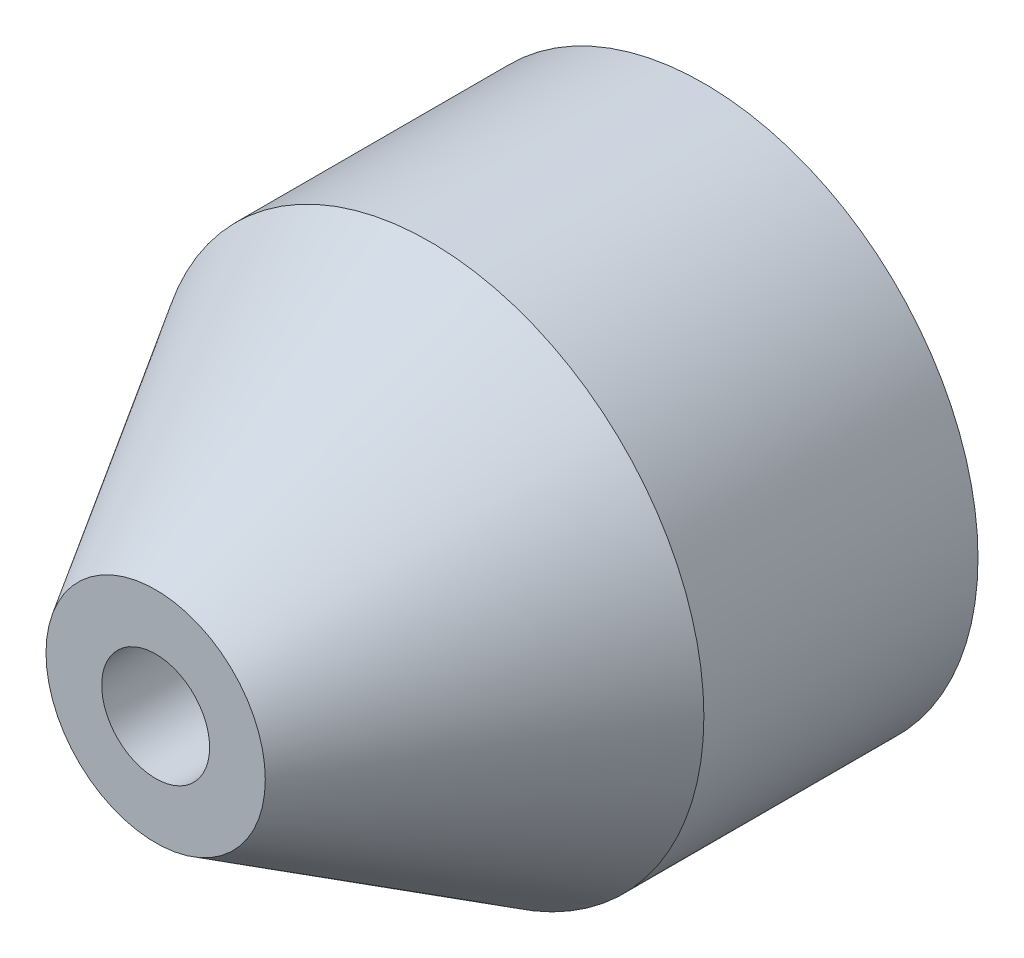
ISO-10303-21;
HEADER;
FILE_DESCRIPTION(('STEP AP214'),'2;1');
FILE_NAME('part.step','',(''),(''),'','','');
FILE_SCHEMA(('AUTOMOTIVE_DESIGN { 1 0 10303 214 1 1 1 1 }'));
ENDSEC;
DATA;
#1=APPLICATION_CONTEXT('core data for automotive mechanical design processes');
#2=APPLICATION_PROTOCOL_DEFINITION('international standard','automotive_design',2000,#1);
#3=PRODUCT_CONTEXT('',#1,'mechanical');
#4=PRODUCT('Part','Part','',(#3));
#5=PRODUCT_RELATED_PRODUCT_CATEGORY('part','',(#4));
#6=PRODUCT_DEFINITION_FORMATION('','',#4);
#7=PRODUCT_DEFINITION_CONTEXT('part definition',#1,'design');
#8=PRODUCT_DEFINITION('design','',#6,#7);
#9=PRODUCT_DEFINITION_SHAPE('','',#8);
#10=(LENGTH_UNIT() NAMED_UNIT(*) SI_UNIT(.MILLI.,.METRE.));
#11=(NAMED_UNIT(*) PLANE_ANGLE_UNIT() SI_UNIT($,.RADIAN.));
#12=(NAMED_UNIT(*) SI_UNIT($,.STERADIAN.) SOLID_ANGLE_UNIT());
#13=UNCERTAINTY_MEASURE_WITH_UNIT(LENGTH_MEASURE(1.E-05),#10,'distance_accuracy_value','');
#14=(GEOMETRIC_REPRESENTATION_CONTEXT(3) GLOBAL_UNCERTAINTY_ASSIGNED_CONTEXT((#13)) GLOBAL_UNIT_ASSIGNED_CONTEXT((#10,
#11,#12)) REPRESENTATION_CONTEXT('',''));
#15=CARTESIAN_POINT('',(0.,0.,0.));
#16=DIRECTION('',(0.,0.,1.));
#17=DIRECTION('',(1.,0.,0.));
#18=AXIS2_PLACEMENT_3D('',#15,#16,#17);
#19=CARTESIAN_POINT('',(0.,0.,12.7));
#20=DIRECTION('',(0.,0.,-1.));
#21=DIRECTION('',(-1.,0.,0.));
#22=AXIS2_PLACEMENT_3D('',#19,#20,#21);
#23=CYLINDRICAL_SURFACE('',#22,6.35);
#24=CARTESIAN_POINT('',(0.,0.,6.34999999999996));
#25=DIRECTION('',(0.,0.,1.));
#26=DIRECTION('',(1.,0.,0.));
#27=AXIS2_PLACEMENT_3D('',#24,#25,#26);
#28=CIRCLE('',#27,6.35);
#29=CARTESIAN_POINT('',(6.35,0.,6.34999999999996));
#30=VERTEX_POINT('',#29);
#31=EDGE_CURVE('E12',#30,#30,#28,.F.);
#32=ORIENTED_EDGE('',*,*,#31,.T.);
#33=EDGE_LOOP('',(#32));
#34=FACE_BOUND('',#33,.T.);
#35=CARTESIAN_POINT('',(0.,0.,0.));
#36=DIRECTION('',(0.,0.,1.));
#37=DIRECTION('',(1.,0.,0.));
#38=AXIS2_PLACEMENT_3D('',#35,#36,#37);
#39=CIRCLE('',#38,6.35);
#40=CARTESIAN_POINT('',(6.35,0.,0.));
#41=VERTEX_POINT('',#40);
#42=EDGE_CURVE('E60',#41,#41,#39,.T.);
#43=ORIENTED_EDGE('',*,*,#42,.T.);
#44=EDGE_LOOP('',(#43));
#45=FACE_BOUND('',#44,.T.);
#46=ADVANCED_FACE('F49',(#34,#45),#23,.T.);
#47=CARTESIAN_POINT('',(0.,0.,12.7));
#48=DIRECTION('',(0.,0.,1.));
#49=DIRECTION('',(1.,0.,0.));
#50=AXIS2_PLACEMENT_3D('',#47,#48,#49);
#51=PLANE('',#50);
#52=CARTESIAN_POINT('',(0.,0.,12.7));
#53=DIRECTION('',(0.,0.,1.));
#54=DIRECTION('',(1.,0.,0.));
#55=AXIS2_PLACEMENT_3D('',#52,#53,#54);
#56=CIRCLE('',#55,2.53999999999999);
#57=CARTESIAN_POINT('',(2.53999999999999,0.,12.7));
#58=VERTEX_POINT('',#57);
#59=EDGE_CURVE('E56',#58,#58,#56,.T.);
#60=ORIENTED_EDGE('',*,*,#59,.T.);
#61=EDGE_LOOP('',(#60));
#62=FACE_BOUND('',#61,.T.);
#63=CARTESIAN_POINT('',(0.,0.,12.7));
#64=DIRECTION('',(0.,0.,1.));
#65=DIRECTION('',(1.,0.,0.));
#66=AXIS2_PLACEMENT_3D('',#63,#64,#65);
#67=CIRCLE('',#66,1.24999999999999);
#68=CARTESIAN_POINT('',(1.24999999999999,0.,12.7));
#69=VERTEX_POINT('',#68);
#70=EDGE_CURVE('E64',#69,#69,#67,.T.);
#71=ORIENTED_EDGE('',*,*,#70,.F.);
#72=EDGE_LOOP('',(#71));
#73=FACE_BOUND('',#72,.T.);
#74=ADVANCED_FACE('F85',(#62,#73),#51,.T.);
#75=CARTESIAN_POINT('',(0.,0.,0.));
#76=DIRECTION('',(0.,0.,1.));
#77=DIRECTION('',(1.,0.,0.));
#78=AXIS2_PLACEMENT_3D('',#75,#76,#77);
#79=PLANE('',#78);
#80=CARTESIAN_POINT('',(0.,0.,0.));
#81=DIRECTION('',(0.,0.,-1.));
#82=DIRECTION('',(-1.,0.,0.));
#83=AXIS2_PLACEMENT_3D('',#80,#81,#82);
#84=CIRCLE('',#83,1.35254999999999);
#85=CARTESIAN_POINT('',(-1.35254999999999,0.,0.));
#86=VERTEX_POINT('',#85);
#87=EDGE_CURVE('E75',#86,#86,#84,.T.);
#88=ORIENTED_EDGE('',*,*,#87,.F.);
#89=EDGE_LOOP('',(#88));
#90=FACE_BOUND('',#89,.T.);
#91=ORIENTED_EDGE('',*,*,#42,.F.);
#92=EDGE_LOOP('',(#91));
#93=FACE_BOUND('',#92,.T.);
#94=ADVANCED_FACE('F81',(#90,#93),#79,.F.);
#95=CARTESIAN_POINT('',(0.,0.,12.7));
#96=DIRECTION('',(0.,0.,1.));
#97=DIRECTION('',(1.,0.,0.));
#98=AXIS2_PLACEMENT_3D('',#95,#96,#97);
#99=CYLINDRICAL_SURFACE('',#98,1.24999999999999);
#100=CARTESIAN_POINT('',(0.,0.,9.45961825648128));
#101=DIRECTION('',(0.,0.,-1.));
#102=DIRECTION('',(-1.,0.,0.));
#103=AXIS2_PLACEMENT_3D('',#100,#101,#102);
#104=CIRCLE('',#103,1.24999999999999);
#105=CARTESIAN_POINT('',(-1.24999999999999,0.,9.45961825648128));
#106=VERTEX_POINT('',#105);
#107=EDGE_CURVE('E67',#106,#106,#104,.T.);
#108=ORIENTED_EDGE('',*,*,#107,.T.);
#109=EDGE_LOOP('',(#108));
#110=FACE_BOUND('',#109,.T.);
#111=ORIENTED_EDGE('',*,*,#70,.T.);
#112=EDGE_LOOP('',(#111));
#113=FACE_BOUND('',#112,.T.);
#114=ADVANCED_FACE('F84',(#110,#113),#99,.F.);
#115=CARTESIAN_POINT('',(0.,0.,9.398));
#116=DIRECTION('',(0.,0.,-1.));
#117=DIRECTION('',(-1.,0.,0.));
#118=AXIS2_PLACEMENT_3D('',#115,#116,#117);
#119=CONICAL_SURFACE('',#118,1.35254999999999,1.02974425867665);
#120=CARTESIAN_POINT('',(0.,0.,9.398));
#121=DIRECTION('',(0.,0.,-1.));
#122=DIRECTION('',(-1.,0.,0.));
#123=AXIS2_PLACEMENT_3D('',#120,#121,#122);
#124=CIRCLE('',#123,1.35254999999999);
#125=CARTESIAN_POINT('',(-1.35254999999999,0.,9.398));
#126=VERTEX_POINT('',#125);
#127=EDGE_CURVE('E69',#126,#126,#124,.T.);
#128=ORIENTED_EDGE('',*,*,#127,.T.);
#129=EDGE_LOOP('',(#128));
#130=FACE_BOUND('',#129,.T.);
#131=ORIENTED_EDGE('',*,*,#107,.F.);
#132=EDGE_LOOP('',(#131));
#133=FACE_BOUND('',#132,.T.);
#134=ADVANCED_FACE('F97',(#130,#133),#119,.F.);
#135=CARTESIAN_POINT('',(0.,0.,0.));
#136=DIRECTION('',(0.,0.,-1.));
#137=DIRECTION('',(-1.,0.,0.));
#138=AXIS2_PLACEMENT_3D('',#135,#136,#137);
#139=CYLINDRICAL_SURFACE('',#138,1.35254999999999);
#140=ORIENTED_EDGE('',*,*,#127,.F.);
#141=EDGE_LOOP('',(#140));
#142=FACE_BOUND('',#141,.T.);
#143=ORIENTED_EDGE('',*,*,#87,.T.);
#144=EDGE_LOOP('',(#143));
#145=FACE_BOUND('',#144,.T.);
#146=ADVANCED_FACE('F79',(#142,#145),#139,.F.);
#147=CARTESIAN_POINT('',(0.,0.,12.7));
#148=DIRECTION('',(0.,0.,-1.));
#149=DIRECTION('',(-1.,0.,0.));
#150=AXIS2_PLACEMENT_3D('',#147,#148,#149);
#151=CONICAL_SURFACE('',#150,2.53999999999999,0.540419500270582);
#152=ORIENTED_EDGE('',*,*,#31,.F.);
#153=EDGE_LOOP('',(#152));
#154=FACE_BOUND('',#153,.T.);
#155=ORIENTED_EDGE('',*,*,#59,.F.);
#156=EDGE_LOOP('',(#155));
#157=FACE_BOUND('',#156,.T.);
#158=ADVANCED_FACE('F51',(#154,#157),#151,.T.);
#159=CLOSED_SHELL('',(#46,#74,#94,#114,#134,#146,#158));
#160=MANIFOLD_SOLID_BREP('B2',#159);
#161=ADVANCED_BREP_SHAPE_REPRESENTATION('',(#18,#160),#14);
#162=SHAPE_DEFINITION_REPRESENTATION(#9,#161);
ENDSEC;
END-ISO-10303-21;
